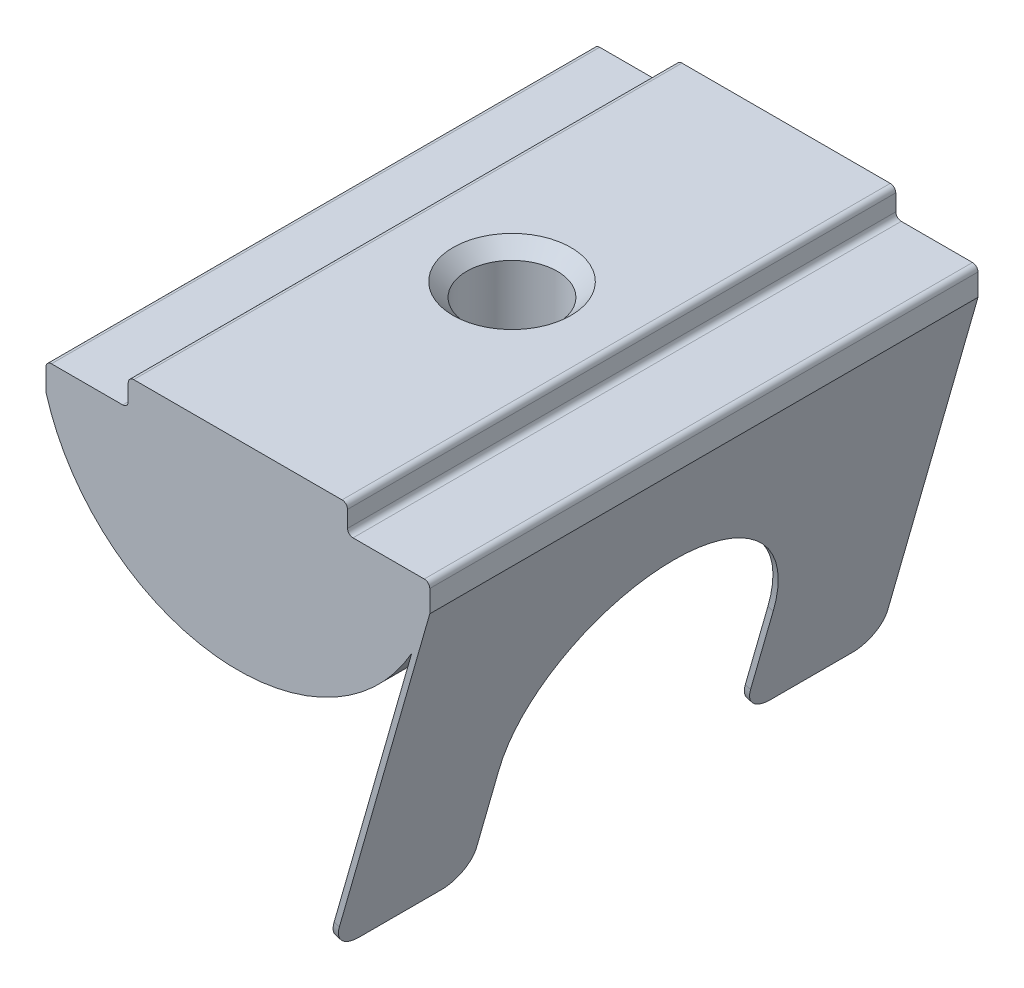
ISO-10303-21;
HEADER;
FILE_DESCRIPTION(('STEP AP214'),'2;1');
FILE_NAME('part.step','',(''),(''),'','','');
FILE_SCHEMA(('AUTOMOTIVE_DESIGN { 1 0 10303 214 1 1 1 1 }'));
ENDSEC;
DATA;
#1=APPLICATION_CONTEXT('core data for automotive mechanical design processes');
#2=APPLICATION_PROTOCOL_DEFINITION('international standard','automotive_design',2000,#1);
#3=PRODUCT_CONTEXT('',#1,'mechanical');
#4=PRODUCT('Part','Part','',(#3));
#5=PRODUCT_RELATED_PRODUCT_CATEGORY('part','',(#4));
#6=PRODUCT_DEFINITION_FORMATION('','',#4);
#7=PRODUCT_DEFINITION_CONTEXT('part definition',#1,'design');
#8=PRODUCT_DEFINITION('design','',#6,#7);
#9=PRODUCT_DEFINITION_SHAPE('','',#8);
#10=(LENGTH_UNIT() NAMED_UNIT(*) SI_UNIT(.MILLI.,.METRE.));
#11=(NAMED_UNIT(*) PLANE_ANGLE_UNIT() SI_UNIT($,.RADIAN.));
#12=(NAMED_UNIT(*) SI_UNIT($,.STERADIAN.) SOLID_ANGLE_UNIT());
#13=UNCERTAINTY_MEASURE_WITH_UNIT(LENGTH_MEASURE(1.E-05),#10,'distance_accuracy_value','');
#14=(GEOMETRIC_REPRESENTATION_CONTEXT(3) GLOBAL_UNCERTAINTY_ASSIGNED_CONTEXT((#13)) GLOBAL_UNIT_ASSIGNED_CONTEXT((#10,
#11,#12)) REPRESENTATION_CONTEXT('',''));
#15=CARTESIAN_POINT('',(0.,0.,0.));
#16=DIRECTION('',(0.,0.,1.));
#17=DIRECTION('',(1.,0.,0.));
#18=AXIS2_PLACEMENT_3D('',#15,#16,#17);
#19=CARTESIAN_POINT('',(3.23632054780592,-14.4448670937512,10.));
#20=DIRECTION('',(0.274721127897363,0.961523947640828,0.));
#21=DIRECTION('',(-0.961523947640828,0.274721127897363,0.));
#22=AXIS2_PLACEMENT_3D('',#19,#20,#21);
#23=PLANE('',#22);
#24=DIRECTION('',(0.,0.,-1.));
#25=VECTOR('',#24,1.);
#26=CARTESIAN_POINT('',(3.23632054780592,-14.4448670937512,10.));
#27=LINE('',#26,#25);
#28=CARTESIAN_POINT('',(3.23632054780592,-14.4448670937512,9.));
#29=VERTEX_POINT('',#28);
#30=CARTESIAN_POINT('',(3.23632054780592,-14.4448670937512,6.));
#31=VERTEX_POINT('',#30);
#32=EDGE_CURVE('E408',#29,#31,#27,.T.);
#33=ORIENTED_EDGE('',*,*,#32,.T.);
#34=DIRECTION('',(0.961523947640828,-0.274721127897363,0.));
#35=VECTOR('',#34,1.);
#36=CARTESIAN_POINT('',(3.23632054780592,-14.4448670937512,6.));
#37=LINE('',#36,#35);
#38=CARTESIAN_POINT('',(3.42862533733408,-14.4998113193307,6.));
#39=VERTEX_POINT('',#38);
#40=EDGE_CURVE('E364',#31,#39,#37,.T.);
#41=ORIENTED_EDGE('',*,*,#40,.T.);
#42=DIRECTION('',(0.,0.,-1.));
#43=VECTOR('',#42,1.);
#44=CARTESIAN_POINT('',(3.42862533733408,-14.4998113193307,10.));
#45=LINE('',#44,#43);
#46=CARTESIAN_POINT('',(3.42862533733408,-14.4998113193307,9.));
#47=VERTEX_POINT('',#46);
#48=EDGE_CURVE('E339',#47,#39,#45,.T.);
#49=ORIENTED_EDGE('',*,*,#48,.F.);
#50=DIRECTION('',(0.961523947640828,-0.274721127897363,0.));
#51=VECTOR('',#50,1.);
#52=CARTESIAN_POINT('',(3.23632054780592,-14.4448670937512,9.));
#53=LINE('',#52,#51);
#54=EDGE_CURVE('E362',#47,#29,#53,.F.);
#55=ORIENTED_EDGE('',*,*,#54,.T.);
#56=EDGE_LOOP('',(#33,#41,#49,#55));
#57=FACE_BOUND('',#56,.T.);
#58=ADVANCED_FACE('F37',(#57),#23,.F.);
#59=CARTESIAN_POINT('',(0.,0.,10.));
#60=DIRECTION('',(0.,0.,-1.));
#61=DIRECTION('',(-1.,0.,0.));
#62=AXIS2_PLACEMENT_3D('',#59,#60,#61);
#63=CYLINDRICAL_SURFACE('',#62,7.28010988928052);
#64=CARTESIAN_POINT('',(0.,-7.28010988928052,1.65));
#65=CARTESIAN_POINT('',(0.0914288787679255,-7.2801082198371,1.64999699864587));
#66=CARTESIAN_POINT('',(0.182893321678644,-7.27837012339703,1.64237505170955));
#67=CARTESIAN_POINT('',(0.36321852410337,-7.27160451149299,1.61212366004075));
#68=CARTESIAN_POINT('',(0.452077473414973,-7.26657476315515,1.58948402800273));
#69=CARTESIAN_POINT('',(0.624560052987028,-7.25378513725579,1.52994727404585));
#70=CARTESIAN_POINT('',(0.708189238726413,-7.24602821680681,1.49306559074817));
#71=CARTESIAN_POINT('',(0.868070701248133,-7.22861874267937,1.40614199091689));
#72=CARTESIAN_POINT('',(0.94432306021343,-7.21896621012297,1.35610022101886));
#73=CARTESIAN_POINT('',(1.08859655261945,-7.19863550807422,1.24336891426646));
#74=CARTESIAN_POINT('',(1.15647304205499,-7.18794384680193,1.18049668063142));
#75=CARTESIAN_POINT('',(1.28081309932715,-7.16683362517621,1.0442811206848));
#76=CARTESIAN_POINT('',(1.33727558851364,-7.1564150907148,0.970936805853192));
#77=CARTESIAN_POINT('',(1.43783317051065,-7.13689705046124,0.814776649738593));
#78=CARTESIAN_POINT('',(1.48177239429586,-7.12781479664393,0.731858088657508));
#79=CARTESIAN_POINT('',(1.55503575188062,-7.11219209572194,0.559573784912798));
#80=CARTESIAN_POINT('',(1.58436177240139,-7.10565132050915,0.470208876248189));
#81=CARTESIAN_POINT('',(1.62708448841284,-7.09598988354713,0.289143058070699));
#82=CARTESIAN_POINT('',(1.64073826930663,-7.09281409187764,0.197505814084215));
#83=CARTESIAN_POINT('',(1.65252865574918,-7.09007676281539,0.0131905573558873));
#84=CARTESIAN_POINT('',(1.65066731485907,-7.09051474710792,-0.079487316028035));
#85=CARTESIAN_POINT('',(1.63168675187842,-7.09490565630921,-0.261327849767084));
#86=CARTESIAN_POINT('',(1.61486799698758,-7.09878935938674,-0.350523799614836));
#87=CARTESIAN_POINT('',(1.56692684975891,-7.10952445924071,-0.524794173124536));
#88=CARTESIAN_POINT('',(1.53580360212171,-7.11637603347176,-0.609868349999675));
#89=CARTESIAN_POINT('',(1.45986590461128,-7.13234195026467,-0.774315456555919));
#90=CARTESIAN_POINT('',(1.41493750026127,-7.14147500326917,-0.853633872459056));
#91=CARTESIAN_POINT('',(1.31274485565373,-7.16096356385985,-1.00371611232099));
#92=CARTESIAN_POINT('',(1.25547881710752,-7.17131924955296,-1.07447868686162));
#93=CARTESIAN_POINT('',(1.12865417143084,-7.19238193245713,-1.20716858782439));
#94=CARTESIAN_POINT('',(1.05884051628025,-7.20309149703341,-1.26885198912381));
#95=CARTESIAN_POINT('',(0.909736490260746,-7.22343631013206,-1.3796767664915));
#96=CARTESIAN_POINT('',(0.830445922319849,-7.23307153630557,-1.42881788167685));
#97=CARTESIAN_POINT('',(0.664329022707597,-7.25021703574624,-1.51323036833926));
#98=CARTESIAN_POINT('',(0.577484944228596,-7.25772211790644,-1.54846793731346));
#99=CARTESIAN_POINT('',(0.398899785948804,-7.26972338580637,-1.60378092019773));
#100=CARTESIAN_POINT('',(0.307159474417913,-7.27422004210938,-1.62385870539031));
#101=CARTESIAN_POINT('',(0.123476668609632,-7.27963018366739,-1.64792313854918));
#102=CARTESIAN_POINT('',(0.0315799173882274,-7.28061779748153,-1.65224273180727));
#103=CARTESIAN_POINT('',(-0.151622261123139,-7.27910712560379,-1.64557318723361));
#104=CARTESIAN_POINT('',(-0.242927731152315,-7.27660909475301,-1.63458516856609));
#105=CARTESIAN_POINT('',(-0.421239367434803,-7.26845477706087,-1.59788806358403));
#106=CARTESIAN_POINT('',(-0.508283707324105,-7.26283633907277,-1.5723553035859));
#107=CARTESIAN_POINT('',(-0.676853135387982,-7.24907086386145,-1.50749057963767));
#108=CARTESIAN_POINT('',(-0.75837772942544,-7.24092360061707,-1.46815738219215));
#109=CARTESIAN_POINT('',(-0.914957756403807,-7.22282245505377,-1.37612639876369));
#110=CARTESIAN_POINT('',(-0.989896501640041,-7.21284307798744,-1.32323521044228));
#111=CARTESIAN_POINT('',(-1.12995400317634,-7.19223359107468,-1.2058424550028));
#112=CARTESIAN_POINT('',(-1.19507138101136,-7.18160339017655,-1.14133926087873));
#113=CARTESIAN_POINT('',(-1.3149677562551,-7.16063162727814,-1.00102083131468));
#114=CARTESIAN_POINT('',(-1.36951540411166,-7.15030000942719,-0.925006146069159));
#115=CARTESIAN_POINT('',(-1.46507312340648,-7.1313353270875,-0.764700301747531));
#116=CARTESIAN_POINT('',(-1.50608379252204,-7.12270218761526,-0.680409508286895));
#117=CARTESIAN_POINT('',(-1.57311711767477,-7.10819805450683,-0.50640221662296));
#118=CARTESIAN_POINT('',(-1.59922604818785,-7.102311198116,-0.416720342588649));
#119=CARTESIAN_POINT('',(-1.63596256430092,-7.09394023215636,-0.234090415447404));
#120=CARTESIAN_POINT('',(-1.64659283762323,-7.09145553183982,-0.141142932253861));
#121=CARTESIAN_POINT('',(-1.65194941173024,-7.09020936046282,0.0430422867175242));
#122=CARTESIAN_POINT('',(-1.64704316976285,-7.09136186297593,0.134268942964806));
#123=CARTESIAN_POINT('',(-1.62229217058587,-7.09706463389533,0.314558899710561));
#124=CARTESIAN_POINT('',(-1.60244761702333,-7.10161485598208,0.403622229683567));
#125=CARTESIAN_POINT('',(-1.54856667070641,-7.11355693440946,0.576739476735561));
#126=CARTESIAN_POINT('',(-1.51458750102536,-7.12093732369248,0.660812047825478));
#127=CARTESIAN_POINT('',(-1.43344969460931,-7.13771186549178,0.822116370436352));
#128=CARTESIAN_POINT('',(-1.38628956988508,-7.1471062453382,0.899347348317315));
#129=CARTESIAN_POINT('',(-1.27892597710097,-7.16710442442731,1.04657913696747));
#130=CARTESIAN_POINT('',(-1.21846226131886,-7.1777300016417,1.11638724898597));
#131=CARTESIAN_POINT('',(-1.08673047685576,-7.19885117873051,1.24498659696387));
#132=CARTESIAN_POINT('',(-1.01545990216251,-7.20934674784501,1.30377527052656));
#133=CARTESIAN_POINT('',(-0.862920881984256,-7.22920188459952,1.40946768616549));
#134=CARTESIAN_POINT('',(-0.781525189589543,-7.23854326792769,1.456191405833));
#135=CARTESIAN_POINT('',(-0.611838092787273,-7.25485311836344,1.53521942894345));
#136=CARTESIAN_POINT('',(-0.523552341123956,-7.26182350603872,1.56753540965211));
#137=CARTESIAN_POINT('',(-0.362694172148548,-7.2714128926126,1.61129975512378));
#138=CARTESIAN_POINT('',(-0.290969186617755,-7.27465354857859,1.62578380327055));
#139=CARTESIAN_POINT('',(-0.146170332290508,-7.27900266012597,1.64513488129974));
#140=CARTESIAN_POINT('',(-0.073096532183408,-7.28011122398489,1.65000239955451));
#141=CARTESIAN_POINT('',(0.,-7.28010988928052,1.65));
#142=B_SPLINE_CURVE_WITH_KNOTS('',3,(#64,#65,#66,#67,#68,#69,#70,#71,#72,#73,#74,#75,#76,#77,
#78,#79,#80,#81,#82,#83,#84,#85,#86,#87,#88,#89,#90,#91,#92,#93,#94,#95,#96,#97,#98,#99,#100,
#101,#102,#103,#104,#105,#106,#107,#108,#109,#110,#111,#112,#113,#114,#115,#116,#117,#118,#119,
#120,#121,#122,#123,#124,#125,#126,#127,#128,#129,#130,#131,#132,#133,#134,#135,#136,#137,#138,
#139,#140,#141),.UNSPECIFIED.,.T.,.F.,(4,2,2,2,2,2,2,2,2,2,2,2,2,2,2,2,2,2,2,2,2,2,2,2,2,2,2,2,
2,2,2,2,2,2,2,2,2,2,4),(0.,0.274019001287356,0.548224074788416,0.822132736077113,
1.09603834548202,1.37415689994708,1.65230172500143,1.93377069813931,2.21520332119292,
2.49195024213205,2.76866053379431,3.03993471128967,3.31122511101863,3.58481793227645,
3.85845065844005,4.13845107685506,4.41845731887961,4.69914018227309,4.97977913235406,
5.25445312343176,5.52910703370413,5.80050008589724,6.07191740162574,6.34744572370006,
6.62301268127326,6.90405976920101,7.18509444683067,7.46448510865182,7.74382725114112,
8.01661238850366,8.28939380718081,8.56108147319115,8.83279982223809,9.11039999305898,
9.38806463555956,9.66965986838943,9.95102645557372,10.1701132069708,10.3891888318323),.UNSPECIFIED.);
#143=CARTESIAN_POINT('',(0.,-7.28010988928052,1.65));
#144=VERTEX_POINT('',#143);
#145=EDGE_CURVE('E273',#144,#144,#142,.T.);
#146=ORIENTED_EDGE('',*,*,#145,.T.);
#147=EDGE_LOOP('',(#146));
#148=FACE_BOUND('',#147,.T.);
#149=DIRECTION('',(0.,0.,-1.));
#150=VECTOR('',#149,1.);
#151=CARTESIAN_POINT('',(6.3421224080087,-3.57456058304149,10.));
#152=LINE('',#151,#150);
#153=CARTESIAN_POINT('',(6.3421224080087,-3.57456058304149,10.));
#154=VERTEX_POINT('',#153);
#155=CARTESIAN_POINT('',(6.3421224080087,-3.57456058304149,-10.));
#156=VERTEX_POINT('',#155);
#157=EDGE_CURVE('E410',#154,#156,#152,.T.);
#158=ORIENTED_EDGE('',*,*,#157,.F.);
#159=CARTESIAN_POINT('',(0.,0.,10.));
#160=DIRECTION('',(0.,0.,1.));
#161=DIRECTION('',(1.,0.,0.));
#162=AXIS2_PLACEMENT_3D('',#159,#160,#161);
#163=CIRCLE('',#162,7.28010988928052);
#164=CARTESIAN_POINT('',(-7.,-2.,10.));
#165=VERTEX_POINT('',#164);
#166=EDGE_CURVE('E238',#165,#154,#163,.T.);
#167=ORIENTED_EDGE('',*,*,#166,.F.);
#168=DIRECTION('',(0.,0.,-1.));
#169=VECTOR('',#168,1.);
#170=CARTESIAN_POINT('',(-7.,-2.,10.));
#171=LINE('',#170,#169);
#172=CARTESIAN_POINT('',(-7.,-2.,-10.));
#173=VERTEX_POINT('',#172);
#174=EDGE_CURVE('E232',#165,#173,#171,.T.);
#175=ORIENTED_EDGE('',*,*,#174,.T.);
#176=CARTESIAN_POINT('',(0.,0.,-10.));
#177=DIRECTION('',(0.,0.,1.));
#178=DIRECTION('',(1.,0.,0.));
#179=AXIS2_PLACEMENT_3D('',#176,#177,#178);
#180=CIRCLE('',#179,7.28010988928052);
#181=EDGE_CURVE('E262',#173,#156,#180,.T.);
#182=ORIENTED_EDGE('',*,*,#181,.T.);
#183=EDGE_LOOP('',(#158,#167,#175,#182));
#184=FACE_BOUND('',#183,.T.);
#185=ADVANCED_FACE('F283',(#148,#184),#63,.T.);
#186=CARTESIAN_POINT('',(4.,-0.999999999999999,10.));
#187=DIRECTION('',(-1.,0.,0.));
#188=DIRECTION('',(0.,0.,1.));
#189=AXIS2_PLACEMENT_3D('',#186,#187,#188);
#190=PLANE('',#189);
#191=DIRECTION('',(0.,1.,0.));
#192=VECTOR('',#191,1.);
#193=CARTESIAN_POINT('',(4.,-0.999999999999999,10.));
#194=LINE('',#193,#192);
#195=CARTESIAN_POINT('',(4.,-0.799999999999999,10.));
#196=VERTEX_POINT('',#195);
#197=CARTESIAN_POINT('',(4.,-0.2,10.));
#198=VERTEX_POINT('',#197);
#199=EDGE_CURVE('E269',#196,#198,#194,.T.);
#200=ORIENTED_EDGE('',*,*,#199,.F.);
#201=DIRECTION('',(0.,0.,-1.));
#202=VECTOR('',#201,1.);
#203=CARTESIAN_POINT('',(4.,-0.799999999999999,-10.));
#204=LINE('',#203,#202);
#205=CARTESIAN_POINT('',(4.,-0.799999999999999,-10.));
#206=VERTEX_POINT('',#205);
#207=EDGE_CURVE('E488',#196,#206,#204,.T.);
#208=ORIENTED_EDGE('',*,*,#207,.T.);
#209=DIRECTION('',(0.,1.,0.));
#210=VECTOR('',#209,1.);
#211=CARTESIAN_POINT('',(4.,-0.999999999999999,-10.));
#212=LINE('',#211,#210);
#213=CARTESIAN_POINT('',(4.,-0.2,-10.));
#214=VERTEX_POINT('',#213);
#215=EDGE_CURVE('E247',#206,#214,#212,.T.);
#216=ORIENTED_EDGE('',*,*,#215,.T.);
#217=DIRECTION('',(0.,0.,-1.));
#218=VECTOR('',#217,1.);
#219=CARTESIAN_POINT('',(4.,-0.2,10.));
#220=LINE('',#219,#218);
#221=EDGE_CURVE('E491',#214,#198,#220,.F.);
#222=ORIENTED_EDGE('',*,*,#221,.T.);
#223=EDGE_LOOP('',(#200,#208,#216,#222));
#224=FACE_BOUND('',#223,.T.);
#225=ADVANCED_FACE('F318',(#224),#190,.F.);
#226=CARTESIAN_POINT('',(-4.,0.,10.));
#227=DIRECTION('',(0.,-1.,0.));
#228=DIRECTION('',(0.,0.,-1.));
#229=AXIS2_PLACEMENT_3D('',#226,#227,#228);
#230=PLANE('',#229);
#231=CARTESIAN_POINT('',(0.,0.,0.));
#232=DIRECTION('',(0.,1.,0.));
#233=DIRECTION('',(0.,0.,1.));
#234=AXIS2_PLACEMENT_3D('',#231,#232,#233);
#235=CIRCLE('',#234,2.15);
#236=CARTESIAN_POINT('',(0.,0.,2.15));
#237=VERTEX_POINT('',#236);
#238=EDGE_CURVE('E413',#237,#237,#235,.T.);
#239=ORIENTED_EDGE('',*,*,#238,.F.);
#240=EDGE_LOOP('',(#239));
#241=FACE_BOUND('',#240,.T.);
#242=DIRECTION('',(-1.,0.,0.));
#243=VECTOR('',#242,1.);
#244=CARTESIAN_POINT('',(-4.,0.,10.));
#245=LINE('',#244,#243);
#246=CARTESIAN_POINT('',(3.8,0.,10.));
#247=VERTEX_POINT('',#246);
#248=CARTESIAN_POINT('',(-3.8,0.,10.));
#249=VERTEX_POINT('',#248);
#250=EDGE_CURVE('E420',#247,#249,#245,.T.);
#251=ORIENTED_EDGE('',*,*,#250,.F.);
#252=DIRECTION('',(0.,0.,-1.));
#253=VECTOR('',#252,1.);
#254=CARTESIAN_POINT('',(3.8,0.,10.));
#255=LINE('',#254,#253);
#256=CARTESIAN_POINT('',(3.8,0.,-10.));
#257=VERTEX_POINT('',#256);
#258=EDGE_CURVE('E483',#247,#257,#255,.T.);
#259=ORIENTED_EDGE('',*,*,#258,.T.);
#260=DIRECTION('',(-1.,0.,0.));
#261=VECTOR('',#260,1.);
#262=CARTESIAN_POINT('',(-4.,0.,-10.));
#263=LINE('',#262,#261);
#264=CARTESIAN_POINT('',(-3.8,0.,-10.));
#265=VERTEX_POINT('',#264);
#266=EDGE_CURVE('E250',#257,#265,#263,.T.);
#267=ORIENTED_EDGE('',*,*,#266,.T.);
#268=DIRECTION('',(0.,0.,-1.));
#269=VECTOR('',#268,1.);
#270=CARTESIAN_POINT('',(-3.8,0.,10.));
#271=LINE('',#270,#269);
#272=EDGE_CURVE('E486',#265,#249,#271,.F.);
#273=ORIENTED_EDGE('',*,*,#272,.T.);
#274=EDGE_LOOP('',(#251,#259,#267,#273));
#275=FACE_BOUND('',#274,.T.);
#276=ADVANCED_FACE('F529',(#241,#275),#230,.F.);
#277=CARTESIAN_POINT('',(-4.,0.,10.));
#278=DIRECTION('',(1.,0.,0.));
#279=DIRECTION('',(0.,0.,-1.));
#280=AXIS2_PLACEMENT_3D('',#277,#278,#279);
#281=PLANE('',#280);
#282=DIRECTION('',(0.,-1.,0.));
#283=VECTOR('',#282,1.);
#284=CARTESIAN_POINT('',(-4.,0.,-10.));
#285=LINE('',#284,#283);
#286=CARTESIAN_POINT('',(-4.,-0.2,-10.));
#287=VERTEX_POINT('',#286);
#288=CARTESIAN_POINT('',(-4.,-0.8,-10.));
#289=VERTEX_POINT('',#288);
#290=EDGE_CURVE('E254',#287,#289,#285,.T.);
#291=ORIENTED_EDGE('',*,*,#290,.T.);
#292=DIRECTION('',(0.,0.,-1.));
#293=VECTOR('',#292,1.);
#294=CARTESIAN_POINT('',(-4.,-0.8,10.));
#295=LINE('',#294,#293);
#296=CARTESIAN_POINT('',(-4.,-0.8,10.));
#297=VERTEX_POINT('',#296);
#298=EDGE_CURVE('E471',#289,#297,#295,.F.);
#299=ORIENTED_EDGE('',*,*,#298,.T.);
#300=DIRECTION('',(0.,-1.,0.));
#301=VECTOR('',#300,1.);
#302=CARTESIAN_POINT('',(-4.,0.,10.));
#303=LINE('',#302,#301);
#304=CARTESIAN_POINT('',(-4.,-0.2,10.));
#305=VERTEX_POINT('',#304);
#306=EDGE_CURVE('E423',#305,#297,#303,.T.);
#307=ORIENTED_EDGE('',*,*,#306,.F.);
#308=DIRECTION('',(0.,0.,-1.));
#309=VECTOR('',#308,1.);
#310=CARTESIAN_POINT('',(-4.,-0.2,10.));
#311=LINE('',#310,#309);
#312=EDGE_CURVE('E473',#305,#287,#311,.T.);
#313=ORIENTED_EDGE('',*,*,#312,.T.);
#314=EDGE_LOOP('',(#291,#299,#307,#313));
#315=FACE_BOUND('',#314,.T.);
#316=ADVANCED_FACE('F538',(#315),#281,.F.);
#317=CARTESIAN_POINT('',(-4.,-1.,10.));
#318=DIRECTION('',(0.,-1.,0.));
#319=DIRECTION('',(1.,0.,0.));
#320=AXIS2_PLACEMENT_3D('',#317,#318,#319);
#321=PLANE('',#320);
#322=DIRECTION('',(-1.,0.,0.));
#323=VECTOR('',#322,1.);
#324=CARTESIAN_POINT('',(-4.,-1.,-10.));
#325=LINE('',#324,#323);
#326=CARTESIAN_POINT('',(-4.2,-1.,-10.));
#327=VERTEX_POINT('',#326);
#328=CARTESIAN_POINT('',(-6.8,-1.,-10.));
#329=VERTEX_POINT('',#328);
#330=EDGE_CURVE('E257',#327,#329,#325,.T.);
#331=ORIENTED_EDGE('',*,*,#330,.T.);
#332=DIRECTION('',(0.,0.,-1.));
#333=VECTOR('',#332,1.);
#334=CARTESIAN_POINT('',(-6.8,-1.,10.));
#335=LINE('',#334,#333);
#336=CARTESIAN_POINT('',(-6.8,-1.,10.));
#337=VERTEX_POINT('',#336);
#338=EDGE_CURVE('E476',#329,#337,#335,.F.);
#339=ORIENTED_EDGE('',*,*,#338,.T.);
#340=DIRECTION('',(-1.,0.,0.));
#341=VECTOR('',#340,1.);
#342=CARTESIAN_POINT('',(-4.,-1.,10.));
#343=LINE('',#342,#341);
#344=CARTESIAN_POINT('',(-4.2,-1.,10.));
#345=VERTEX_POINT('',#344);
#346=EDGE_CURVE('E426',#345,#337,#343,.T.);
#347=ORIENTED_EDGE('',*,*,#346,.F.);
#348=DIRECTION('',(0.,0.,-1.));
#349=VECTOR('',#348,1.);
#350=CARTESIAN_POINT('',(-4.2,-1.,-10.));
#351=LINE('',#350,#349);
#352=EDGE_CURVE('E478',#345,#327,#351,.T.);
#353=ORIENTED_EDGE('',*,*,#352,.T.);
#354=EDGE_LOOP('',(#331,#339,#347,#353));
#355=FACE_BOUND('',#354,.T.);
#356=ADVANCED_FACE('F309',(#355),#321,.F.);
#357=CARTESIAN_POINT('',(-7.,-1.,10.));
#358=DIRECTION('',(1.,0.,0.));
#359=DIRECTION('',(0.,1.,0.));
#360=AXIS2_PLACEMENT_3D('',#357,#358,#359);
#361=PLANE('',#360);
#362=DIRECTION('',(0.,-1.,0.));
#363=VECTOR('',#362,1.);
#364=CARTESIAN_POINT('',(-7.,-1.,10.));
#365=LINE('',#364,#363);
#366=CARTESIAN_POINT('',(-7.,-1.2,10.));
#367=VERTEX_POINT('',#366);
#368=EDGE_CURVE('E243',#367,#165,#365,.T.);
#369=ORIENTED_EDGE('',*,*,#368,.F.);
#370=DIRECTION('',(0.,0.,-1.));
#371=VECTOR('',#370,1.);
#372=CARTESIAN_POINT('',(-7.,-1.2,10.));
#373=LINE('',#372,#371);
#374=CARTESIAN_POINT('',(-7.,-1.2,-10.));
#375=VERTEX_POINT('',#374);
#376=EDGE_CURVE('E481',#367,#375,#373,.T.);
#377=ORIENTED_EDGE('',*,*,#376,.T.);
#378=DIRECTION('',(0.,-1.,0.));
#379=VECTOR('',#378,1.);
#380=CARTESIAN_POINT('',(-7.,-1.,-10.));
#381=LINE('',#380,#379);
#382=EDGE_CURVE('E260',#375,#173,#381,.T.);
#383=ORIENTED_EDGE('',*,*,#382,.T.);
#384=ORIENTED_EDGE('',*,*,#174,.F.);
#385=EDGE_LOOP('',(#369,#377,#383,#384));
#386=FACE_BOUND('',#385,.T.);
#387=ADVANCED_FACE('F305',(#386),#361,.F.);
#388=CARTESIAN_POINT('',(7.,-0.999999999999999,10.));
#389=DIRECTION('',(-1.,0.,0.));
#390=DIRECTION('',(0.,0.,1.));
#391=AXIS2_PLACEMENT_3D('',#388,#389,#390);
#392=PLANE('',#391);
#393=DIRECTION('',(0.,1.,0.));
#394=VECTOR('',#393,1.);
#395=CARTESIAN_POINT('',(7.,-0.999999999999999,-10.));
#396=LINE('',#395,#394);
#397=CARTESIAN_POINT('',(7.,-2.,-10.));
#398=VERTEX_POINT('',#397);
#399=CARTESIAN_POINT('',(7.,-1.2,-10.));
#400=VERTEX_POINT('',#399);
#401=EDGE_CURVE('E265',#398,#400,#396,.T.);
#402=ORIENTED_EDGE('',*,*,#401,.T.);
#403=DIRECTION('',(0.,0.,-1.));
#404=VECTOR('',#403,1.);
#405=CARTESIAN_POINT('',(7.,-1.2,10.));
#406=LINE('',#405,#404);
#407=CARTESIAN_POINT('',(7.,-1.2,10.));
#408=VERTEX_POINT('',#407);
#409=EDGE_CURVE('E237',#400,#408,#406,.F.);
#410=ORIENTED_EDGE('',*,*,#409,.T.);
#411=DIRECTION('',(0.,1.,0.));
#412=VECTOR('',#411,1.);
#413=CARTESIAN_POINT('',(7.,-0.999999999999999,10.));
#414=LINE('',#413,#412);
#415=CARTESIAN_POINT('',(7.,-2.,10.));
#416=VERTEX_POINT('',#415);
#417=EDGE_CURVE('E216',#416,#408,#414,.T.);
#418=ORIENTED_EDGE('',*,*,#417,.F.);
#419=DIRECTION('',(0.,0.,-1.));
#420=VECTOR('',#419,1.);
#421=CARTESIAN_POINT('',(7.,-2.,10.));
#422=LINE('',#421,#420);
#423=EDGE_CURVE('E224',#416,#398,#422,.T.);
#424=ORIENTED_EDGE('',*,*,#423,.T.);
#425=EDGE_LOOP('',(#402,#410,#418,#424));
#426=FACE_BOUND('',#425,.T.);
#427=ADVANCED_FACE('F235',(#426),#392,.F.);
#428=CARTESIAN_POINT('',(4.,-0.999999999999999,10.));
#429=DIRECTION('',(0.,-1.,0.));
#430=DIRECTION('',(1.,0.,0.));
#431=AXIS2_PLACEMENT_3D('',#428,#429,#430);
#432=PLANE('',#431);
#433=DIRECTION('',(-1.,0.,0.));
#434=VECTOR('',#433,1.);
#435=CARTESIAN_POINT('',(4.,-0.999999999999999,10.));
#436=LINE('',#435,#434);
#437=CARTESIAN_POINT('',(6.8,-0.999999999999999,10.));
#438=VERTEX_POINT('',#437);
#439=CARTESIAN_POINT('',(4.2,-0.999999999999999,10.));
#440=VERTEX_POINT('',#439);
#441=EDGE_CURVE('E233',#438,#440,#436,.T.);
#442=ORIENTED_EDGE('',*,*,#441,.F.);
#443=DIRECTION('',(0.,0.,-1.));
#444=VECTOR('',#443,1.);
#445=CARTESIAN_POINT('',(6.8,-0.999999999999999,10.));
#446=LINE('',#445,#444);
#447=CARTESIAN_POINT('',(6.8,-0.999999999999999,-10.));
#448=VERTEX_POINT('',#447);
#449=EDGE_CURVE('E508',#438,#448,#446,.T.);
#450=ORIENTED_EDGE('',*,*,#449,.T.);
#451=DIRECTION('',(-1.,0.,0.));
#452=VECTOR('',#451,1.);
#453=CARTESIAN_POINT('',(4.,-0.999999999999999,-10.));
#454=LINE('',#453,#452);
#455=CARTESIAN_POINT('',(4.2,-0.999999999999999,-10.));
#456=VERTEX_POINT('',#455);
#457=EDGE_CURVE('E267',#448,#456,#454,.T.);
#458=ORIENTED_EDGE('',*,*,#457,.T.);
#459=DIRECTION('',(0.,0.,-1.));
#460=VECTOR('',#459,1.);
#461=CARTESIAN_POINT('',(4.2,-0.999999999999999,10.));
#462=LINE('',#461,#460);
#463=EDGE_CURVE('E281',#456,#440,#462,.F.);
#464=ORIENTED_EDGE('',*,*,#463,.T.);
#465=EDGE_LOOP('',(#442,#450,#458,#464));
#466=FACE_BOUND('',#465,.T.);
#467=ADVANCED_FACE('F298',(#466),#432,.F.);
#468=CARTESIAN_POINT('',(0.,0.,10.));
#469=DIRECTION('',(0.,0.,1.));
#470=DIRECTION('',(1.,0.,0.));
#471=AXIS2_PLACEMENT_3D('',#468,#469,#470);
#472=PLANE('',#471);
#473=DIRECTION('',(-0.274721127897378,-0.961523947640823,0.));
#474=VECTOR('',#473,1.);
#475=CARTESIAN_POINT('',(6.80769521047183,-1.94505577442053,10.));
#476=LINE('',#475,#474);
#477=CARTESIAN_POINT('',(3.51104167570329,-13.4833431461104,10.));
#478=VERTEX_POINT('',#477);
#479=EDGE_CURVE('E221',#154,#478,#476,.T.);
#480=ORIENTED_EDGE('',*,*,#479,.T.);
#481=DIRECTION('',(0.961523947640828,-0.274721127897363,0.));
#482=VECTOR('',#481,1.);
#483=CARTESIAN_POINT('',(3.70334646523144,-13.5382873716899,10.));
#484=LINE('',#483,#482);
#485=CARTESIAN_POINT('',(3.70334646523146,-13.5382873716899,10.));
#486=VERTEX_POINT('',#485);
#487=EDGE_CURVE('E219',#478,#486,#484,.T.);
#488=ORIENTED_EDGE('',*,*,#487,.T.);
#489=DIRECTION('',(0.274721127897378,0.961523947640823,0.));
#490=VECTOR('',#489,1.);
#491=CARTESIAN_POINT('',(7.,-2.,10.));
#492=LINE('',#491,#490);
#493=EDGE_CURVE('E211',#486,#416,#492,.T.);
#494=ORIENTED_EDGE('',*,*,#493,.T.);
#495=ORIENTED_EDGE('',*,*,#417,.T.);
#496=CARTESIAN_POINT('',(6.8,-1.2,10.));
#497=DIRECTION('',(0.,0.,1.));
#498=DIRECTION('',(1.,0.,0.));
#499=AXIS2_PLACEMENT_3D('',#496,#497,#498);
#500=CIRCLE('',#499,0.2);
#501=EDGE_CURVE('E493',#408,#438,#500,.T.);
#502=ORIENTED_EDGE('',*,*,#501,.T.);
#503=ORIENTED_EDGE('',*,*,#441,.T.);
#504=CARTESIAN_POINT('',(4.2,-0.799999999999999,10.));
#505=DIRECTION('',(0.,0.,1.));
#506=DIRECTION('',(1.,0.,0.));
#507=AXIS2_PLACEMENT_3D('',#504,#505,#506);
#508=CIRCLE('',#507,0.2);
#509=EDGE_CURVE('E467',#440,#196,#508,.F.);
#510=ORIENTED_EDGE('',*,*,#509,.T.);
#511=ORIENTED_EDGE('',*,*,#199,.T.);
#512=CARTESIAN_POINT('',(3.8,-0.2,10.));
#513=DIRECTION('',(0.,0.,1.));
#514=DIRECTION('',(1.,0.,0.));
#515=AXIS2_PLACEMENT_3D('',#512,#513,#514);
#516=CIRCLE('',#515,0.2);
#517=EDGE_CURVE('E495',#198,#247,#516,.T.);
#518=ORIENTED_EDGE('',*,*,#517,.T.);
#519=ORIENTED_EDGE('',*,*,#250,.T.);
#520=CARTESIAN_POINT('',(-3.8,-0.2,10.));
#521=DIRECTION('',(0.,0.,1.));
#522=DIRECTION('',(1.,0.,0.));
#523=AXIS2_PLACEMENT_3D('',#520,#521,#522);
#524=CIRCLE('',#523,0.2);
#525=EDGE_CURVE('E498',#249,#305,#524,.T.);
#526=ORIENTED_EDGE('',*,*,#525,.T.);
#527=ORIENTED_EDGE('',*,*,#306,.T.);
#528=CARTESIAN_POINT('',(-4.2,-0.8,10.));
#529=DIRECTION('',(0.,0.,1.));
#530=DIRECTION('',(1.,0.,0.));
#531=AXIS2_PLACEMENT_3D('',#528,#529,#530);
#532=CIRCLE('',#531,0.2);
#533=EDGE_CURVE('E463',#297,#345,#532,.F.);
#534=ORIENTED_EDGE('',*,*,#533,.T.);
#535=ORIENTED_EDGE('',*,*,#346,.T.);
#536=CARTESIAN_POINT('',(-6.8,-1.2,10.));
#537=DIRECTION('',(0.,0.,1.));
#538=DIRECTION('',(1.,0.,0.));
#539=AXIS2_PLACEMENT_3D('',#536,#537,#538);
#540=CIRCLE('',#539,0.2);
#541=EDGE_CURVE('E432',#337,#367,#540,.T.);
#542=ORIENTED_EDGE('',*,*,#541,.T.);
#543=ORIENTED_EDGE('',*,*,#368,.T.);
#544=ORIENTED_EDGE('',*,*,#166,.T.);
#545=EDGE_LOOP('',(#480,#488,#494,#495,#502,#503,#510,#511,#518,#519,#526,#527,#534,#535,#542,
#543,#544));
#546=FACE_BOUND('',#545,.T.);
#547=ADVANCED_FACE('F214',(#546),#472,.T.);
#548=CARTESIAN_POINT('',(0.,0.,-10.));
#549=DIRECTION('',(0.,0.,1.));
#550=DIRECTION('',(1.,0.,0.));
#551=AXIS2_PLACEMENT_3D('',#548,#549,#550);
#552=PLANE('',#551);
#553=DIRECTION('',(0.274721127897378,0.961523947640823,0.));
#554=VECTOR('',#553,1.);
#555=CARTESIAN_POINT('',(7.,-2.,-10.));
#556=LINE('',#555,#554);
#557=CARTESIAN_POINT('',(3.70334646523146,-13.5382873716899,-10.));
#558=VERTEX_POINT('',#557);
#559=EDGE_CURVE('E228',#558,#398,#556,.T.);
#560=ORIENTED_EDGE('',*,*,#559,.F.);
#561=DIRECTION('',(0.961523947640828,-0.274721127897363,0.));
#562=VECTOR('',#561,1.);
#563=CARTESIAN_POINT('',(-3.29665353476838,-11.53828737169,-10.));
#564=LINE('',#563,#562);
#565=CARTESIAN_POINT('',(3.51104167570329,-13.4833431461104,-10.));
#566=VERTEX_POINT('',#565);
#567=EDGE_CURVE('E360',#558,#566,#564,.F.);
#568=ORIENTED_EDGE('',*,*,#567,.T.);
#569=DIRECTION('',(-0.274721127897378,-0.961523947640823,0.));
#570=VECTOR('',#569,1.);
#571=CARTESIAN_POINT('',(6.80769521047183,-1.94505577442053,-10.));
#572=LINE('',#571,#570);
#573=EDGE_CURVE('E386',#156,#566,#572,.T.);
#574=ORIENTED_EDGE('',*,*,#573,.F.);
#575=ORIENTED_EDGE('',*,*,#181,.F.);
#576=ORIENTED_EDGE('',*,*,#382,.F.);
#577=CARTESIAN_POINT('',(-6.8,-1.2,-10.));
#578=DIRECTION('',(0.,0.,1.));
#579=DIRECTION('',(1.,0.,0.));
#580=AXIS2_PLACEMENT_3D('',#577,#578,#579);
#581=CIRCLE('',#580,0.2);
#582=EDGE_CURVE('E505',#375,#329,#581,.F.);
#583=ORIENTED_EDGE('',*,*,#582,.T.);
#584=ORIENTED_EDGE('',*,*,#330,.F.);
#585=CARTESIAN_POINT('',(-4.2,-0.8,-10.));
#586=DIRECTION('',(0.,0.,1.));
#587=DIRECTION('',(1.,0.,0.));
#588=AXIS2_PLACEMENT_3D('',#585,#586,#587);
#589=CIRCLE('',#588,0.2);
#590=EDGE_CURVE('E465',#327,#289,#589,.T.);
#591=ORIENTED_EDGE('',*,*,#590,.T.);
#592=ORIENTED_EDGE('',*,*,#290,.F.);
#593=CARTESIAN_POINT('',(-3.8,-0.2,-10.));
#594=DIRECTION('',(0.,0.,1.));
#595=DIRECTION('',(1.,0.,0.));
#596=AXIS2_PLACEMENT_3D('',#593,#594,#595);
#597=CIRCLE('',#596,0.2);
#598=EDGE_CURVE('E507',#287,#265,#597,.F.);
#599=ORIENTED_EDGE('',*,*,#598,.T.);
#600=ORIENTED_EDGE('',*,*,#266,.F.);
#601=CARTESIAN_POINT('',(3.8,-0.2,-10.));
#602=DIRECTION('',(0.,0.,1.));
#603=DIRECTION('',(1.,0.,0.));
#604=AXIS2_PLACEMENT_3D('',#601,#602,#603);
#605=CIRCLE('',#604,0.2);
#606=EDGE_CURVE('E503',#257,#214,#605,.F.);
#607=ORIENTED_EDGE('',*,*,#606,.T.);
#608=ORIENTED_EDGE('',*,*,#215,.F.);
#609=CARTESIAN_POINT('',(4.2,-0.799999999999999,-10.));
#610=DIRECTION('',(0.,0.,1.));
#611=DIRECTION('',(1.,0.,0.));
#612=AXIS2_PLACEMENT_3D('',#609,#610,#611);
#613=CIRCLE('',#612,0.2);
#614=EDGE_CURVE('E469',#206,#456,#613,.T.);
#615=ORIENTED_EDGE('',*,*,#614,.T.);
#616=ORIENTED_EDGE('',*,*,#457,.F.);
#617=CARTESIAN_POINT('',(6.8,-1.2,-10.));
#618=DIRECTION('',(0.,0.,1.));
#619=DIRECTION('',(1.,0.,0.));
#620=AXIS2_PLACEMENT_3D('',#617,#618,#619);
#621=CIRCLE('',#620,0.2);
#622=EDGE_CURVE('E501',#448,#400,#621,.F.);
#623=ORIENTED_EDGE('',*,*,#622,.T.);
#624=ORIENTED_EDGE('',*,*,#401,.F.);
#625=EDGE_LOOP('',(#560,#568,#574,#575,#576,#583,#584,#591,#592,#599,#600,#607,#608,#615,#616,
#623,#624));
#626=FACE_BOUND('',#625,.T.);
#627=ADVANCED_FACE('F293',(#626),#552,.F.);
#628=CARTESIAN_POINT('',(0.,0.,0.));
#629=DIRECTION('',(0.,1.,0.));
#630=DIRECTION('',(0.,0.,1.));
#631=AXIS2_PLACEMENT_3D('',#628,#629,#630);
#632=CYLINDRICAL_SURFACE('',#631,1.65);
#633=CARTESIAN_POINT('',(0.,-0.499999999999999,0.));
#634=DIRECTION('',(0.,1.,0.));
#635=DIRECTION('',(0.,0.,1.));
#636=AXIS2_PLACEMENT_3D('',#633,#634,#635);
#637=CIRCLE('',#636,1.65);
#638=CARTESIAN_POINT('',(0.,-0.499999999999999,1.65));
#639=VERTEX_POINT('',#638);
#640=EDGE_CURVE('E251',#639,#639,#637,.T.);
#641=ORIENTED_EDGE('',*,*,#640,.T.);
#642=EDGE_LOOP('',(#641));
#643=FACE_BOUND('',#642,.T.);
#644=ORIENTED_EDGE('',*,*,#145,.F.);
#645=EDGE_LOOP('',(#644));
#646=FACE_BOUND('',#645,.T.);
#647=ADVANCED_FACE('F287',(#643,#646),#632,.F.);
#648=CARTESIAN_POINT('',(0.,0.,0.));
#649=DIRECTION('',(0.,1.,0.));
#650=DIRECTION('',(0.,0.,1.));
#651=AXIS2_PLACEMENT_3D('',#648,#649,#650);
#652=CONICAL_SURFACE('',#651,2.15,0.78539816339745);
#653=ORIENTED_EDGE('',*,*,#640,.F.);
#654=EDGE_LOOP('',(#653));
#655=FACE_BOUND('',#654,.T.);
#656=ORIENTED_EDGE('',*,*,#238,.T.);
#657=EDGE_LOOP('',(#656));
#658=FACE_BOUND('',#657,.T.);
#659=ADVANCED_FACE('F292',(#655,#658),#652,.F.);
#660=CARTESIAN_POINT('',(6.80769521047183,-1.94505577442053,10.));
#661=DIRECTION('',(0.961523947640823,-0.274721127897378,0.));
#662=DIRECTION('',(0.274721127897378,0.961523947640823,0.));
#663=AXIS2_PLACEMENT_3D('',#660,#661,#662);
#664=PLANE('',#663);
#665=CARTESIAN_POINT('',(3.23632054780592,-14.4448670937512,-6.));
#666=VERTEX_POINT('',#665);
#667=CARTESIAN_POINT('',(3.23632054780592,-14.4448670937512,-9.));
#668=VERTEX_POINT('',#667);
#669=EDGE_CURVE('E411',#666,#668,#27,.T.);
#670=ORIENTED_EDGE('',*,*,#669,.F.);
#671=CARTESIAN_POINT('',(3.51104167570329,-13.4833431461104,-6.));
#672=DIRECTION('',(0.961523947640823,-0.274721127897378,0.));
#673=DIRECTION('',(0.274721127897378,0.961523947640823,0.));
#674=AXIS2_PLACEMENT_3D('',#671,#672,#673);
#675=CIRCLE('',#674,1.);
#676=CARTESIAN_POINT('',(3.51104167570329,-13.4833431461104,-5.));
#677=VERTEX_POINT('',#676);
#678=EDGE_CURVE('E348',#666,#677,#675,.F.);
#679=ORIENTED_EDGE('',*,*,#678,.T.);
#680=DIRECTION('',(-0.274721127897378,-0.961523947640823,0.));
#681=VECTOR('',#680,1.);
#682=CARTESIAN_POINT('',(3.23632054780592,-14.4448670937512,-5.));
#683=LINE('',#682,#681);
#684=CARTESIAN_POINT('',(4.33520505939543,-10.5987713031879,-5.));
#685=VERTEX_POINT('',#684);
#686=EDGE_CURVE('E391',#685,#677,#683,.T.);
#687=ORIENTED_EDGE('',*,*,#686,.F.);
#688=CARTESIAN_POINT('',(4.33520505939543,-10.5987713031879,0.));
#689=DIRECTION('',(0.961523947640823,-0.274721127897378,0.));
#690=DIRECTION('',(0.274721127897378,0.961523947640823,0.));
#691=AXIS2_PLACEMENT_3D('',#688,#689,#690);
#692=CIRCLE('',#691,5.);
#693=CARTESIAN_POINT('',(5.70881069888232,-5.79115156498382,0.));
#694=VERTEX_POINT('',#693);
#695=EDGE_CURVE('E11',#685,#694,#692,.T.);
#696=ORIENTED_EDGE('',*,*,#695,.T.);
#697=CARTESIAN_POINT('',(4.33520505939543,-10.5987713031879,0.));
#698=DIRECTION('',(0.961523947640823,-0.274721127897378,0.));
#699=DIRECTION('',(0.274721127897378,0.961523947640823,0.));
#700=AXIS2_PLACEMENT_3D('',#697,#698,#699);
#701=CIRCLE('',#700,5.);
#702=CARTESIAN_POINT('',(4.33520505939543,-10.5987713031879,5.));
#703=VERTEX_POINT('',#702);
#704=EDGE_CURVE('E376',#694,#703,#701,.T.);
#705=ORIENTED_EDGE('',*,*,#704,.T.);
#706=DIRECTION('',(0.274721127897378,0.961523947640823,0.));
#707=VECTOR('',#706,1.);
#708=CARTESIAN_POINT('',(3.23632054780592,-14.4448670937512,5.));
#709=LINE('',#708,#707);
#710=CARTESIAN_POINT('',(3.51104167570329,-13.4833431461104,5.));
#711=VERTEX_POINT('',#710);
#712=EDGE_CURVE('E396',#711,#703,#709,.T.);
#713=ORIENTED_EDGE('',*,*,#712,.F.);
#714=CARTESIAN_POINT('',(3.51104167570329,-13.4833431461104,6.));
#715=DIRECTION('',(0.961523947640823,-0.274721127897378,0.));
#716=DIRECTION('',(0.274721127897378,0.961523947640823,0.));
#717=AXIS2_PLACEMENT_3D('',#714,#715,#716);
#718=CIRCLE('',#717,1.);
#719=EDGE_CURVE('E351',#711,#31,#718,.F.);
#720=ORIENTED_EDGE('',*,*,#719,.T.);
#721=ORIENTED_EDGE('',*,*,#32,.F.);
#722=CARTESIAN_POINT('',(3.51104167570329,-13.4833431461104,9.));
#723=DIRECTION('',(0.961523947640823,-0.274721127897378,0.));
#724=DIRECTION('',(0.274721127897378,0.961523947640823,0.));
#725=AXIS2_PLACEMENT_3D('',#722,#723,#724);
#726=CIRCLE('',#725,1.);
#727=EDGE_CURVE('E349',#29,#478,#726,.F.);
#728=ORIENTED_EDGE('',*,*,#727,.T.);
#729=ORIENTED_EDGE('',*,*,#479,.F.);
#730=ORIENTED_EDGE('',*,*,#157,.T.);
#731=ORIENTED_EDGE('',*,*,#573,.T.);
#732=CARTESIAN_POINT('',(3.51104167570329,-13.4833431461104,-9.));
#733=DIRECTION('',(0.961523947640823,-0.274721127897378,0.));
#734=DIRECTION('',(0.274721127897378,0.961523947640823,0.));
#735=AXIS2_PLACEMENT_3D('',#732,#733,#734);
#736=CIRCLE('',#735,1.);
#737=EDGE_CURVE('E357',#566,#668,#736,.F.);
#738=ORIENTED_EDGE('',*,*,#737,.T.);
#739=EDGE_LOOP('',(#670,#679,#687,#696,#705,#713,#720,#721,#728,#729,#730,#731,#738));
#740=FACE_BOUND('',#739,.T.);
#741=ADVANCED_FACE('F323',(#740),#664,.F.);
#742=CARTESIAN_POINT('',(3.42862533733408,-14.4998113193307,-6.));
#743=VERTEX_POINT('',#742);
#744=CARTESIAN_POINT('',(3.42862533733408,-14.4998113193307,-9.));
#745=VERTEX_POINT('',#744);
#746=EDGE_CURVE('E220',#743,#745,#45,.T.);
#747=ORIENTED_EDGE('',*,*,#746,.F.);
#748=DIRECTION('',(0.961523947640828,-0.274721127897363,0.));
#749=VECTOR('',#748,1.);
#750=CARTESIAN_POINT('',(3.23632054780592,-14.4448670937512,-6.));
#751=LINE('',#750,#749);
#752=EDGE_CURVE('E335',#743,#666,#751,.F.);
#753=ORIENTED_EDGE('',*,*,#752,.T.);
#754=ORIENTED_EDGE('',*,*,#669,.T.);
#755=DIRECTION('',(0.961523947640828,-0.274721127897363,0.));
#756=VECTOR('',#755,1.);
#757=CARTESIAN_POINT('',(3.23632054780592,-14.4448670937512,-9.));
#758=LINE('',#757,#756);
#759=EDGE_CURVE('E338',#668,#745,#758,.T.);
#760=ORIENTED_EDGE('',*,*,#759,.T.);
#761=EDGE_LOOP('',(#747,#753,#754,#760));
#762=FACE_BOUND('',#761,.T.);
#763=ADVANCED_FACE('F314',(#762),#23,.F.);
#764=CARTESIAN_POINT('',(7.,-2.,10.));
#765=DIRECTION('',(-0.961523947640823,0.274721127897378,0.));
#766=DIRECTION('',(-0.274721127897378,-0.961523947640823,0.));
#767=AXIS2_PLACEMENT_3D('',#764,#765,#766);
#768=PLANE('',#767);
#769=DIRECTION('',(0.274721127897378,0.961523947640823,0.));
#770=VECTOR('',#769,1.);
#771=CARTESIAN_POINT('',(3.42862533733408,-14.4998113193307,-5.));
#772=LINE('',#771,#770);
#773=CARTESIAN_POINT('',(3.70334646523146,-13.5382873716899,-5.));
#774=VERTEX_POINT('',#773);
#775=CARTESIAN_POINT('',(4.52750984892359,-10.6537155287674,-5.));
#776=VERTEX_POINT('',#775);
#777=EDGE_CURVE('E379',#774,#776,#772,.T.);
#778=ORIENTED_EDGE('',*,*,#777,.F.);
#779=CARTESIAN_POINT('',(3.70334646523146,-13.5382873716899,-6.));
#780=DIRECTION('',(-0.961523947640823,0.274721127897378,0.));
#781=DIRECTION('',(-0.274721127897378,-0.961523947640823,0.));
#782=AXIS2_PLACEMENT_3D('',#779,#780,#781);
#783=CIRCLE('',#782,1.);
#784=EDGE_CURVE('E345',#774,#743,#783,.F.);
#785=ORIENTED_EDGE('',*,*,#784,.T.);
#786=ORIENTED_EDGE('',*,*,#746,.T.);
#787=CARTESIAN_POINT('',(3.70334646523146,-13.5382873716899,-9.));
#788=DIRECTION('',(-0.961523947640823,0.274721127897378,0.));
#789=DIRECTION('',(-0.274721127897378,-0.961523947640823,0.));
#790=AXIS2_PLACEMENT_3D('',#787,#788,#789);
#791=CIRCLE('',#790,1.);
#792=EDGE_CURVE('E444',#745,#558,#791,.F.);
#793=ORIENTED_EDGE('',*,*,#792,.T.);
#794=ORIENTED_EDGE('',*,*,#559,.T.);
#795=ORIENTED_EDGE('',*,*,#423,.F.);
#796=ORIENTED_EDGE('',*,*,#493,.F.);
#797=CARTESIAN_POINT('',(3.70334646523146,-13.5382873716899,9.));
#798=DIRECTION('',(-0.961523947640823,0.274721127897378,0.));
#799=DIRECTION('',(-0.274721127897378,-0.961523947640823,0.));
#800=AXIS2_PLACEMENT_3D('',#797,#798,#799);
#801=CIRCLE('',#800,1.);
#802=EDGE_CURVE('E449',#486,#47,#801,.F.);
#803=ORIENTED_EDGE('',*,*,#802,.T.);
#804=ORIENTED_EDGE('',*,*,#48,.T.);
#805=CARTESIAN_POINT('',(3.70334646523146,-13.5382873716899,6.));
#806=DIRECTION('',(-0.961523947640823,0.274721127897378,0.));
#807=DIRECTION('',(-0.274721127897378,-0.961523947640823,0.));
#808=AXIS2_PLACEMENT_3D('',#805,#806,#807);
#809=CIRCLE('',#808,1.);
#810=CARTESIAN_POINT('',(3.70334646523146,-13.5382873716899,5.));
#811=VERTEX_POINT('',#810);
#812=EDGE_CURVE('E448',#39,#811,#809,.F.);
#813=ORIENTED_EDGE('',*,*,#812,.T.);
#814=DIRECTION('',(-0.274721127897378,-0.961523947640823,0.));
#815=VECTOR('',#814,1.);
#816=CARTESIAN_POINT('',(3.42862533733408,-14.4998113193307,5.));
#817=LINE('',#816,#815);
#818=CARTESIAN_POINT('',(4.5275098489236,-10.6537155287674,5.));
#819=VERTEX_POINT('',#818);
#820=EDGE_CURVE('E387',#819,#811,#817,.T.);
#821=ORIENTED_EDGE('',*,*,#820,.F.);
#822=CARTESIAN_POINT('',(4.5275098489236,-10.6537155287674,0.));
#823=DIRECTION('',(-0.961523947640823,0.274721127897378,0.));
#824=DIRECTION('',(-0.274721127897378,-0.961523947640823,0.));
#825=AXIS2_PLACEMENT_3D('',#822,#823,#824);
#826=CIRCLE('',#825,5.);
#827=CARTESIAN_POINT('',(5.90111548841049,-5.84609579056329,0.));
#828=VERTEX_POINT('',#827);
#829=EDGE_CURVE('E59',#819,#828,#826,.T.);
#830=ORIENTED_EDGE('',*,*,#829,.T.);
#831=CARTESIAN_POINT('',(4.5275098489236,-10.6537155287674,0.));
#832=DIRECTION('',(-0.961523947640823,0.274721127897378,0.));
#833=DIRECTION('',(-0.274721127897378,-0.961523947640823,0.));
#834=AXIS2_PLACEMENT_3D('',#831,#832,#833);
#835=CIRCLE('',#834,5.);
#836=EDGE_CURVE('E46',#828,#776,#835,.T.);
#837=ORIENTED_EDGE('',*,*,#836,.T.);
#838=EDGE_LOOP('',(#778,#785,#786,#793,#794,#795,#796,#803,#804,#813,#821,#830,#837));
#839=FACE_BOUND('',#838,.T.);
#840=ADVANCED_FACE('F226',(#839),#768,.F.);
#841=CARTESIAN_POINT('',(-10.0442614551187,-10.6504150929156,5.));
#842=DIRECTION('',(0.,0.,1.));
#843=DIRECTION('',(1.,0.,0.));
#844=AXIS2_PLACEMENT_3D('',#841,#842,#843);
#845=PLANE('',#844);
#846=ORIENTED_EDGE('',*,*,#712,.T.);
#847=DIRECTION('',(0.961523947640823,-0.274721127897378,0.));
#848=VECTOR('',#847,1.);
#849=CARTESIAN_POINT('',(4.5275098489236,-10.6537155287674,5.));
#850=LINE('',#849,#848);
#851=EDGE_CURVE('E370',#703,#819,#850,.T.);
#852=ORIENTED_EDGE('',*,*,#851,.T.);
#853=ORIENTED_EDGE('',*,*,#820,.T.);
#854=DIRECTION('',(0.961523947640828,-0.274721127897363,0.));
#855=VECTOR('',#854,1.);
#856=CARTESIAN_POINT('',(-9.76954032722145,-9.68889114527499,5.));
#857=LINE('',#856,#855);
#858=EDGE_CURVE('E367',#811,#711,#857,.F.);
#859=ORIENTED_EDGE('',*,*,#858,.T.);
#860=EDGE_LOOP('',(#846,#852,#853,#859));
#861=FACE_BOUND('',#860,.T.);
#862=ADVANCED_FACE('F329',(#861),#845,.F.);
#863=CARTESIAN_POINT('',(-10.0442614551187,-10.6504150929156,-5.));
#864=DIRECTION('',(0.,0.,-1.));
#865=DIRECTION('',(-1.,0.,0.));
#866=AXIS2_PLACEMENT_3D('',#863,#864,#865);
#867=PLANE('',#866);
#868=ORIENTED_EDGE('',*,*,#777,.T.);
#869=DIRECTION('',(0.961523947640823,-0.274721127897378,0.));
#870=VECTOR('',#869,1.);
#871=CARTESIAN_POINT('',(4.33520505939544,-10.5987713031879,-5.));
#872=LINE('',#871,#870);
#873=EDGE_CURVE('E373',#776,#685,#872,.F.);
#874=ORIENTED_EDGE('',*,*,#873,.T.);
#875=ORIENTED_EDGE('',*,*,#686,.T.);
#876=DIRECTION('',(0.961523947640828,-0.274721127897363,0.));
#877=VECTOR('',#876,1.);
#878=CARTESIAN_POINT('',(-9.76954032722145,-9.68889114527499,-5.));
#879=LINE('',#878,#877);
#880=EDGE_CURVE('E385',#677,#774,#879,.T.);
#881=ORIENTED_EDGE('',*,*,#880,.T.);
#882=EDGE_LOOP('',(#868,#874,#875,#881));
#883=FACE_BOUND('',#882,.T.);
#884=ADVANCED_FACE('F384',(#883),#867,.F.);
#885=CARTESIAN_POINT('',(6.8,-1.2,10.));
#886=DIRECTION('',(0.,0.,-1.));
#887=DIRECTION('',(-1.,0.,0.));
#888=AXIS2_PLACEMENT_3D('',#885,#886,#887);
#889=CYLINDRICAL_SURFACE('',#888,0.2);
#890=ORIENTED_EDGE('',*,*,#501,.F.);
#891=ORIENTED_EDGE('',*,*,#409,.F.);
#892=ORIENTED_EDGE('',*,*,#622,.F.);
#893=ORIENTED_EDGE('',*,*,#449,.F.);
#894=EDGE_LOOP('',(#890,#891,#892,#893));
#895=FACE_BOUND('',#894,.T.);
#896=ADVANCED_FACE('F620',(#895),#889,.T.);
#897=CARTESIAN_POINT('',(4.2,-0.799999999999999,10.));
#898=DIRECTION('',(0.,0.,1.));
#899=DIRECTION('',(1.,0.,0.));
#900=AXIS2_PLACEMENT_3D('',#897,#898,#899);
#901=CYLINDRICAL_SURFACE('',#900,0.2);
#902=ORIENTED_EDGE('',*,*,#509,.F.);
#903=ORIENTED_EDGE('',*,*,#463,.F.);
#904=ORIENTED_EDGE('',*,*,#614,.F.);
#905=ORIENTED_EDGE('',*,*,#207,.F.);
#906=EDGE_LOOP('',(#902,#903,#904,#905));
#907=FACE_BOUND('',#906,.T.);
#908=ADVANCED_FACE('F518',(#907),#901,.F.);
#909=CARTESIAN_POINT('',(3.8,-0.2,10.));
#910=DIRECTION('',(0.,0.,-1.));
#911=DIRECTION('',(-1.,0.,0.));
#912=AXIS2_PLACEMENT_3D('',#909,#910,#911);
#913=CYLINDRICAL_SURFACE('',#912,0.2);
#914=ORIENTED_EDGE('',*,*,#517,.F.);
#915=ORIENTED_EDGE('',*,*,#221,.F.);
#916=ORIENTED_EDGE('',*,*,#606,.F.);
#917=ORIENTED_EDGE('',*,*,#258,.F.);
#918=EDGE_LOOP('',(#914,#915,#916,#917));
#919=FACE_BOUND('',#918,.T.);
#920=ADVANCED_FACE('F526',(#919),#913,.T.);
#921=CARTESIAN_POINT('',(-6.8,-1.2,10.));
#922=DIRECTION('',(0.,0.,-1.));
#923=DIRECTION('',(-1.,0.,0.));
#924=AXIS2_PLACEMENT_3D('',#921,#922,#923);
#925=CYLINDRICAL_SURFACE('',#924,0.2);
#926=ORIENTED_EDGE('',*,*,#541,.F.);
#927=ORIENTED_EDGE('',*,*,#338,.F.);
#928=ORIENTED_EDGE('',*,*,#582,.F.);
#929=ORIENTED_EDGE('',*,*,#376,.F.);
#930=EDGE_LOOP('',(#926,#927,#928,#929));
#931=FACE_BOUND('',#930,.T.);
#932=ADVANCED_FACE('F549',(#931),#925,.T.);
#933=CARTESIAN_POINT('',(-4.2,-0.8,10.));
#934=DIRECTION('',(0.,0.,1.));
#935=DIRECTION('',(1.,0.,0.));
#936=AXIS2_PLACEMENT_3D('',#933,#934,#935);
#937=CYLINDRICAL_SURFACE('',#936,0.2);
#938=ORIENTED_EDGE('',*,*,#533,.F.);
#939=ORIENTED_EDGE('',*,*,#298,.F.);
#940=ORIENTED_EDGE('',*,*,#590,.F.);
#941=ORIENTED_EDGE('',*,*,#352,.F.);
#942=EDGE_LOOP('',(#938,#939,#940,#941));
#943=FACE_BOUND('',#942,.T.);
#944=ADVANCED_FACE('F544',(#943),#937,.F.);
#945=CARTESIAN_POINT('',(-3.8,-0.2,10.));
#946=DIRECTION('',(0.,0.,-1.));
#947=DIRECTION('',(-1.,0.,0.));
#948=AXIS2_PLACEMENT_3D('',#945,#946,#947);
#949=CYLINDRICAL_SURFACE('',#948,0.2);
#950=ORIENTED_EDGE('',*,*,#525,.F.);
#951=ORIENTED_EDGE('',*,*,#272,.F.);
#952=ORIENTED_EDGE('',*,*,#598,.F.);
#953=ORIENTED_EDGE('',*,*,#312,.F.);
#954=EDGE_LOOP('',(#950,#951,#952,#953));
#955=FACE_BOUND('',#954,.T.);
#956=ADVANCED_FACE('F535',(#955),#949,.T.);
#957=CARTESIAN_POINT('',(-9.76954032722145,-9.68889114527499,-6.));
#958=DIRECTION('',(0.961523947640828,-0.274721127897363,0.));
#959=DIRECTION('',(0.274721127897363,0.961523947640828,0.));
#960=AXIS2_PLACEMENT_3D('',#957,#958,#959);
#961=CYLINDRICAL_SURFACE('',#960,1.);
#962=ORIENTED_EDGE('',*,*,#678,.F.);
#963=ORIENTED_EDGE('',*,*,#752,.F.);
#964=ORIENTED_EDGE('',*,*,#784,.F.);
#965=ORIENTED_EDGE('',*,*,#880,.F.);
#966=EDGE_LOOP('',(#962,#963,#964,#965));
#967=FACE_BOUND('',#966,.T.);
#968=ADVANCED_FACE('F343',(#967),#961,.T.);
#969=CARTESIAN_POINT('',(3.51104167570328,-13.4833431461104,-9.));
#970=DIRECTION('',(0.961523947640828,-0.274721127897363,0.));
#971=DIRECTION('',(0.274721127897363,0.961523947640828,0.));
#972=AXIS2_PLACEMENT_3D('',#969,#970,#971);
#973=CYLINDRICAL_SURFACE('',#972,1.);
#974=ORIENTED_EDGE('',*,*,#737,.F.);
#975=ORIENTED_EDGE('',*,*,#567,.F.);
#976=ORIENTED_EDGE('',*,*,#792,.F.);
#977=ORIENTED_EDGE('',*,*,#759,.F.);
#978=EDGE_LOOP('',(#974,#975,#976,#977));
#979=FACE_BOUND('',#978,.T.);
#980=ADVANCED_FACE('F443',(#979),#973,.T.);
#981=CARTESIAN_POINT('',(3.51104167570328,-13.4833431461104,6.));
#982=DIRECTION('',(0.961523947640828,-0.274721127897363,0.));
#983=DIRECTION('',(0.274721127897363,0.961523947640828,0.));
#984=AXIS2_PLACEMENT_3D('',#981,#982,#983);
#985=CYLINDRICAL_SURFACE('',#984,1.);
#986=ORIENTED_EDGE('',*,*,#719,.F.);
#987=ORIENTED_EDGE('',*,*,#858,.F.);
#988=ORIENTED_EDGE('',*,*,#812,.F.);
#989=ORIENTED_EDGE('',*,*,#40,.F.);
#990=EDGE_LOOP('',(#986,#987,#988,#989));
#991=FACE_BOUND('',#990,.T.);
#992=ADVANCED_FACE('F457',(#991),#985,.T.);
#993=CARTESIAN_POINT('',(-3.29665353476838,-11.53828737169,9.));
#994=DIRECTION('',(-0.961523947640828,0.274721127897363,0.));
#995=DIRECTION('',(-0.274721127897363,-0.961523947640828,0.));
#996=AXIS2_PLACEMENT_3D('',#993,#994,#995);
#997=CYLINDRICAL_SURFACE('',#996,1.);
#998=ORIENTED_EDGE('',*,*,#727,.F.);
#999=ORIENTED_EDGE('',*,*,#54,.F.);
#1000=ORIENTED_EDGE('',*,*,#802,.F.);
#1001=ORIENTED_EDGE('',*,*,#487,.F.);
#1002=EDGE_LOOP('',(#998,#999,#1000,#1001));
#1003=FACE_BOUND('',#1002,.T.);
#1004=ADVANCED_FACE('F455',(#1003),#997,.T.);
#1005=CARTESIAN_POINT('',(-8.94537694352923,-6.80431930235231,0.));
#1006=DIRECTION('',(-0.961523947640823,0.274721127897378,0.));
#1007=DIRECTION('',(-0.274721127897378,-0.961523947640823,0.));
#1008=AXIS2_PLACEMENT_3D('',#1005,#1006,#1007);
#1009=CYLINDRICAL_SURFACE('',#1008,5.);
#1010=DIRECTION('',(0.961523947640823,-0.274721127897378,0.));
#1011=VECTOR('',#1010,1.);
#1012=CARTESIAN_POINT('',(5.90111548841049,-5.8460957905633,0.));
#1013=LINE('',#1012,#1011);
#1014=EDGE_CURVE('E41',#694,#828,#1013,.T.);
#1015=ORIENTED_EDGE('',*,*,#1014,.F.);
#1016=ORIENTED_EDGE('',*,*,#695,.F.);
#1017=ORIENTED_EDGE('',*,*,#873,.F.);
#1018=ORIENTED_EDGE('',*,*,#836,.F.);
#1019=EDGE_LOOP('',(#1015,#1016,#1017,#1018));
#1020=FACE_BOUND('',#1019,.T.);
#1021=ADVANCED_FACE('F39',(#1020),#1009,.F.);
#1022=CARTESIAN_POINT('',(-8.94537694352923,-6.80431930235231,0.));
#1023=DIRECTION('',(-0.961523947640823,0.274721127897378,0.));
#1024=DIRECTION('',(-0.274721127897378,-0.961523947640823,0.));
#1025=AXIS2_PLACEMENT_3D('',#1022,#1023,#1024);
#1026=CYLINDRICAL_SURFACE('',#1025,5.);
#1027=ORIENTED_EDGE('',*,*,#704,.F.);
#1028=ORIENTED_EDGE('',*,*,#1014,.T.);
#1029=ORIENTED_EDGE('',*,*,#829,.F.);
#1030=ORIENTED_EDGE('',*,*,#851,.F.);
#1031=EDGE_LOOP('',(#1027,#1028,#1029,#1030));
#1032=FACE_BOUND('',#1031,.T.);
#1033=ADVANCED_FACE('F393',(#1032),#1026,.F.);
#1034=CLOSED_SHELL('',(#58,#185,#225,#276,#316,#356,#387,#427,#467,#547,#627,#647,#659,#741,
#763,#840,#862,#884,#896,#908,#920,#932,#944,#956,#968,#980,#992,#1004,#1021,#1033));
#1035=MANIFOLD_SOLID_BREP('B2',#1034);
#1036=ADVANCED_BREP_SHAPE_REPRESENTATION('',(#18,#1035),#14);
#1037=SHAPE_DEFINITION_REPRESENTATION(#9,#1036);
ENDSEC;
END-ISO-10303-21;
